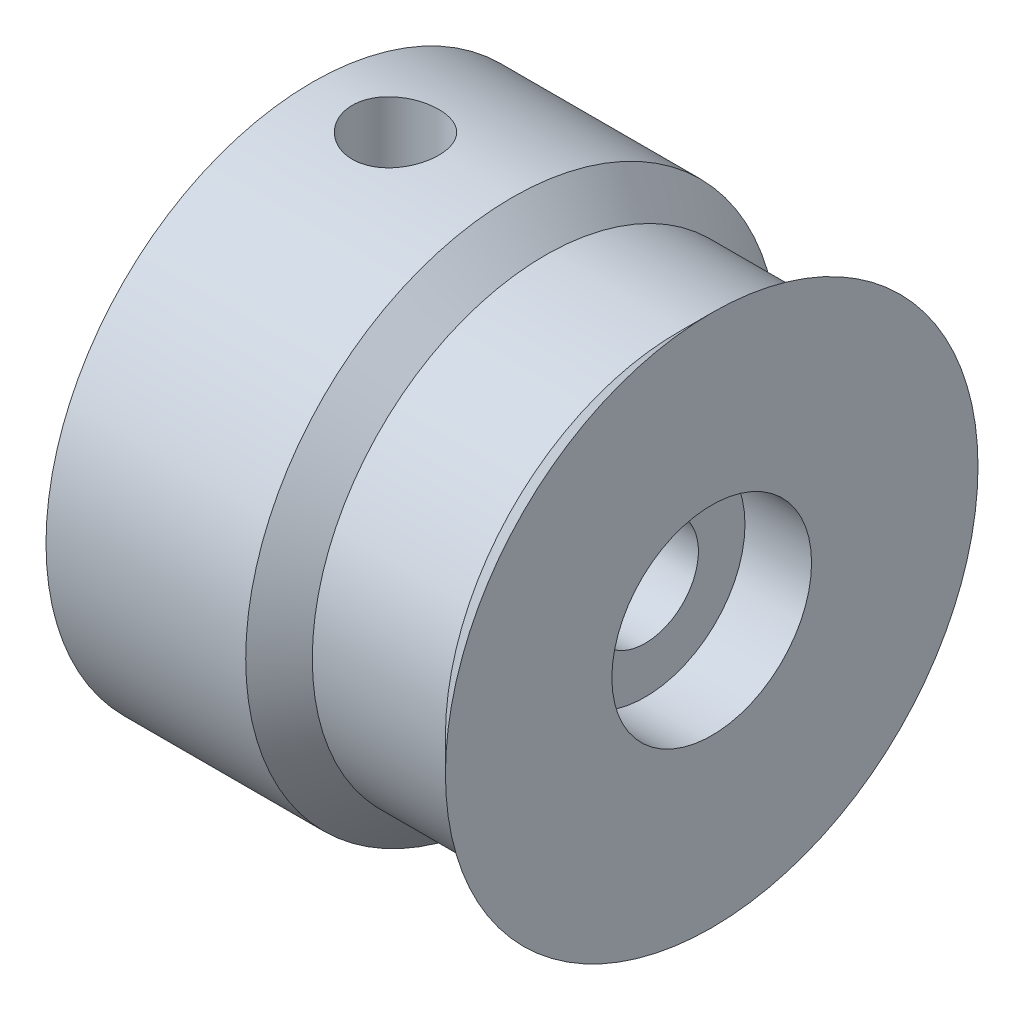
ISO-10303-21;
HEADER;
FILE_DESCRIPTION(('STEP AP214'),'2;1');
FILE_NAME('part.step','',(''),(''),'','','');
FILE_SCHEMA(('AUTOMOTIVE_DESIGN { 1 0 10303 214 1 1 1 1 }'));
ENDSEC;
DATA;
#1=APPLICATION_CONTEXT('core data for automotive mechanical design processes');
#2=APPLICATION_PROTOCOL_DEFINITION('international standard','automotive_design',2000,#1);
#3=PRODUCT_CONTEXT('',#1,'mechanical');
#4=PRODUCT('Part','Part','',(#3));
#5=PRODUCT_RELATED_PRODUCT_CATEGORY('part','',(#4));
#6=PRODUCT_DEFINITION_FORMATION('','',#4);
#7=PRODUCT_DEFINITION_CONTEXT('part definition',#1,'design');
#8=PRODUCT_DEFINITION('design','',#6,#7);
#9=PRODUCT_DEFINITION_SHAPE('','',#8);
#10=(LENGTH_UNIT() NAMED_UNIT(*) SI_UNIT(.MILLI.,.METRE.));
#11=(NAMED_UNIT(*) PLANE_ANGLE_UNIT() SI_UNIT($,.RADIAN.));
#12=(NAMED_UNIT(*) SI_UNIT($,.STERADIAN.) SOLID_ANGLE_UNIT());
#13=UNCERTAINTY_MEASURE_WITH_UNIT(LENGTH_MEASURE(1.E-05),#10,'distance_accuracy_value','');
#14=(GEOMETRIC_REPRESENTATION_CONTEXT(3) GLOBAL_UNCERTAINTY_ASSIGNED_CONTEXT((#13)) GLOBAL_UNIT_ASSIGNED_CONTEXT((#10,
#11,#12)) REPRESENTATION_CONTEXT('',''));
#15=CARTESIAN_POINT('',(0.,0.,0.));
#16=DIRECTION('',(0.,0.,1.));
#17=DIRECTION('',(1.,0.,0.));
#18=AXIS2_PLACEMENT_3D('',#15,#16,#17);
#19=CARTESIAN_POINT('',(0.,0.,0.));
#20=DIRECTION('',(-1.,0.,0.));
#21=DIRECTION('',(0.,0.,1.));
#22=AXIS2_PLACEMENT_3D('',#19,#20,#21);
#23=CYLINDRICAL_SURFACE('',#22,4.5);
#24=CARTESIAN_POINT('',(2.5,-4.3081318457076,1.3));
#25=CARTESIAN_POINT('',(2.42863313340239,-4.30813279337262,1.29999879655539));
#26=CARTESIAN_POINT('',(2.35725418050508,-4.30992460250792,1.29410319221496));
#27=CARTESIAN_POINT('',(2.21657434262258,-4.31687214490348,1.27073167094706));
#28=CARTESIAN_POINT('',(2.14727428056843,-4.32202919238679,1.25325122976364));
#29=CARTESIAN_POINT('',(2.01280849936003,-4.33507545889643,1.20734607027228));
#30=CARTESIAN_POINT('',(1.94763646231685,-4.34296037725375,1.17893857135605));
#31=CARTESIAN_POINT('',(1.82296911633117,-4.36056825441867,1.11204142797774));
#32=CARTESIAN_POINT('',(1.76347452173565,-4.37029144406354,1.07355051707678));
#33=CARTESIAN_POINT('',(1.65010507916228,-4.39080022895354,0.98637030903215));
#34=CARTESIAN_POINT('',(1.59642148830366,-4.4016071843155,0.937437270307317));
#35=CARTESIAN_POINT('',(1.49789697508779,-4.4228827226542,0.831284833703608));
#36=CARTESIAN_POINT('',(1.45305710970524,-4.43335126506001,0.77406444676219));
#37=CARTESIAN_POINT('',(1.37267381425754,-4.4530116193173,0.651612873102253));
#38=CARTESIAN_POINT('',(1.33732371314498,-4.46217531657916,0.586249867602601));
#39=CARTESIAN_POINT('',(1.27818976446839,-4.47794638161977,0.450197924487183));
#40=CARTESIAN_POINT('',(1.25440361234816,-4.4845542586891,0.379510051299344));
#41=CARTESIAN_POINT('',(1.21970087002154,-4.49431805545872,0.236814351710887));
#42=CARTESIAN_POINT('',(1.20845819821795,-4.49756127708926,0.164891906721939));
#43=CARTESIAN_POINT('',(1.1981322650655,-4.50053702343425,0.0201134330144835));
#44=CARTESIAN_POINT('',(1.19904662933593,-4.50027023368624,-0.0527424106257846));
#45=CARTESIAN_POINT('',(1.21278621210107,-4.49631851041019,-0.195038192165016));
#46=CARTESIAN_POINT('',(1.22525860652349,-4.49273483318493,-0.264515447716657));
#47=CARTESIAN_POINT('',(1.26118606229288,-4.48267381509879,-0.400345137085308));
#48=CARTESIAN_POINT('',(1.28464179826871,-4.47619629649084,-0.466697378679286));
#49=CARTESIAN_POINT('',(1.34211971729442,-4.46093192671849,-0.595253525445509));
#50=CARTESIAN_POINT('',(1.37625625238594,-4.45212024987467,-0.657403234305083));
#51=CARTESIAN_POINT('',(1.45403729655884,-4.43312741609808,-0.77520764005173));
#52=CARTESIAN_POINT('',(1.49768392755008,-4.42294595373053,-0.830860883172866));
#53=CARTESIAN_POINT('',(1.59509133277135,-4.40187720157316,-0.93619885317004));
#54=CARTESIAN_POINT('',(1.64915860875884,-4.39097769333332,-0.985598074303785));
#55=CARTESIAN_POINT('',(1.76491893964752,-4.37002396309914,-1.07470529597395));
#56=CARTESIAN_POINT('',(1.82661264166663,-4.35996981295697,-1.11441247326905));
#57=CARTESIAN_POINT('',(1.95657991051588,-4.34178979127668,-1.18327766553921));
#58=CARTESIAN_POINT('',(2.02490396013413,-4.33368066234716,-1.21234514489363));
#59=CARTESIAN_POINT('',(2.16576439552729,-4.32051009837503,-1.25848109175824));
#60=CARTESIAN_POINT('',(2.23829951660482,-4.31544775344034,-1.27555314184071));
#61=CARTESIAN_POINT('',(2.38282184098649,-4.30914165688786,-1.29669443440491));
#62=CARTESIAN_POINT('',(2.45474050023348,-4.30777132725947,-1.30119489180942));
#63=CARTESIAN_POINT('',(2.5983055701485,-4.30865565372649,-1.29826392009081));
#64=CARTESIAN_POINT('',(2.66995201448997,-4.31090984579008,-1.29083401836002));
#65=CARTESIAN_POINT('',(2.80918855044871,-4.31866565307569,-1.26463600768684));
#66=CARTESIAN_POINT('',(2.87683443903039,-4.32408951592606,-1.24613912260729));
#67=CARTESIAN_POINT('',(3.00806023636331,-4.33749455345838,-1.19864336546959));
#68=CARTESIAN_POINT('',(3.07163954761862,-4.34547610290657,-1.16964295429609));
#69=CARTESIAN_POINT('',(3.19469860739096,-4.36334757007066,-1.10112580806327));
#70=CARTESIAN_POINT('',(3.25403461584527,-4.37328052154304,-1.06136240904809));
#71=CARTESIAN_POINT('',(3.36534977334943,-4.39384020295062,-0.972745307116469));
#72=CARTESIAN_POINT('',(3.41732728700106,-4.40446708634517,-0.923889589032521));
#73=CARTESIAN_POINT('',(3.51430268373141,-4.42566266708536,-0.816458539964099));
#74=CARTESIAN_POINT('',(3.55899653204609,-4.43621660553728,-0.75760521027823));
#75=CARTESIAN_POINT('',(3.63787734308449,-4.45570415572188,-0.632986454057171));
#76=CARTESIAN_POINT('',(3.67206485049052,-4.46463785144328,-0.5672213860859));
#77=CARTESIAN_POINT('',(3.72863492647104,-4.47982185418223,-0.431097666090435));
#78=CARTESIAN_POINT('',(3.75110673971043,-4.48609237794587,-0.360778469683259));
#79=CARTESIAN_POINT('',(3.78384862342349,-4.49533282609701,-0.217149993572304));
#80=CARTESIAN_POINT('',(3.79412190904628,-4.49830362017639,-0.143841507022852));
#81=CARTESIAN_POINT('',(3.80194521743192,-4.5005609969933,0.00086478569657411));
#82=CARTESIAN_POINT('',(3.79993778585208,-4.4999757305733,0.0722369779856471));
#83=CARTESIAN_POINT('',(3.78430407336059,-4.49548456821128,0.213584667702757));
#84=CARTESIAN_POINT('',(3.770678370665,-4.49157883752157,0.283560234460442));
#85=CARTESIAN_POINT('',(3.73246125574994,-4.48091846816225,0.419499089830076));
#86=CARTESIAN_POINT('',(3.70797322399843,-4.47419071966314,0.485493693782462));
#87=CARTESIAN_POINT('',(3.64881860497552,-4.45858419784331,0.61247364431595));
#88=CARTESIAN_POINT('',(3.61415041921729,-4.44970508675414,0.673458202294096));
#89=CARTESIAN_POINT('',(3.53440142553314,-4.43040042487549,0.790689821396192));
#90=CARTESIAN_POINT('',(3.4890374084932,-4.41993622519236,0.846737818365894));
#91=CARTESIAN_POINT('',(3.38970372155392,-4.39877503190667,0.950574554932919));
#92=CARTESIAN_POINT('',(3.33573165248964,-4.38807797412368,0.998360984173664));
#93=CARTESIAN_POINT('',(3.2189614577137,-4.36732427882032,1.08560952040857));
#94=CARTESIAN_POINT('',(3.15596420294237,-4.35729276608927,1.12481171852487));
#95=CARTESIAN_POINT('',(3.02399206857295,-4.3393903261111,1.19201870329893));
#96=CARTESIAN_POINT('',(2.95502045814742,-4.33151822693584,1.22002956735153));
#97=CARTESIAN_POINT('',(2.82210275824001,-4.31971524804284,1.26113306764733));
#98=CARTESIAN_POINT('',(2.75863347012585,-4.31541039934175,1.27567015216104));
#99=CARTESIAN_POINT('',(2.63011262613961,-4.30961850077265,1.29510336433635));
#100=CARTESIAN_POINT('',(2.56506133552479,-4.30813098177235,1.30000109711575));
#101=CARTESIAN_POINT('',(2.5,-4.3081318457076,1.3));
#102=B_SPLINE_CURVE_WITH_KNOTS('',3,(#24,#25,#26,#27,#28,#29,#30,#31,#32,#33,#34,#35,#36,#37,
#38,#39,#40,#41,#42,#43,#44,#45,#46,#47,#48,#49,#50,#51,#52,#53,#54,#55,#56,#57,#58,#59,#60,#61,
#62,#63,#64,#65,#66,#67,#68,#69,#70,#71,#72,#73,#74,#75,#76,#77,#78,#79,#80,#81,#82,#83,#84,#85,
#86,#87,#88,#89,#90,#91,#92,#93,#94,#95,#96,#97,#98,#99,#100,#101),.UNSPECIFIED.,.T.,.F.,(4,2,2,
2,2,2,2,2,2,2,2,2,2,2,2,2,2,2,2,2,2,2,2,2,2,2,2,2,2,2,2,2,2,2,2,2,2,2,4),(0.,0.213860870542837,
0.4278053099732,0.641413977441894,0.855049486234427,1.07435981505186,1.29369633929887,
1.51721041433874,1.74067992742904,1.95819395425293,2.17566549921533,2.38670967120679,
2.59776680784726,2.81116572194292,3.0246122988385,3.24571109914732,3.4668286730377,
3.68978629948542,3.91267730874919,4.1278231775052,4.34294150426129,4.55299216669133,
4.76307362097933,4.97845072919737,5.19387562928726,5.41676062860847,5.63963407090831,
5.86078400399119,6.08187563594332,6.29504813910956,6.5082100337637,6.71938532617077,
6.93059379504957,7.14819007172284,7.36584710135083,7.58938717467547,7.81280569020901,
8.00780362177071,8.20276908007593),.UNSPECIFIED.);
#103=CARTESIAN_POINT('',(2.5,-4.3081318457076,1.3));
#104=VERTEX_POINT('',#103);
#105=EDGE_CURVE('E78',#104,#104,#102,.T.);
#106=ORIENTED_EDGE('',*,*,#105,.T.);
#107=EDGE_LOOP('',(#106));
#108=FACE_BOUND('',#107,.T.);
#109=CARTESIAN_POINT('',(2.5,4.3081318457076,1.3));
#110=CARTESIAN_POINT('',(2.57136686659761,4.30813279337262,1.29999879655539));
#111=CARTESIAN_POINT('',(2.64274581949492,4.30992460250792,1.29410319221496));
#112=CARTESIAN_POINT('',(2.78342565737742,4.31687214490348,1.27073167094706));
#113=CARTESIAN_POINT('',(2.85272571943157,4.32202919238679,1.25325122976364));
#114=CARTESIAN_POINT('',(2.98719150063997,4.33507545889643,1.20734607027228));
#115=CARTESIAN_POINT('',(3.05236353768315,4.34296037725375,1.17893857135605));
#116=CARTESIAN_POINT('',(3.17703088366883,4.36056825441867,1.11204142797774));
#117=CARTESIAN_POINT('',(3.23652547826435,4.37029144406354,1.07355051707678));
#118=CARTESIAN_POINT('',(3.34989492083772,4.39080022895354,0.98637030903215));
#119=CARTESIAN_POINT('',(3.40357851169634,4.4016071843155,0.937437270307317));
#120=CARTESIAN_POINT('',(3.50210302491221,4.4228827226542,0.831284833703608));
#121=CARTESIAN_POINT('',(3.54694289029476,4.43335126506001,0.774064446762191));
#122=CARTESIAN_POINT('',(3.62732618574246,4.4530116193173,0.651612873102254));
#123=CARTESIAN_POINT('',(3.66267628685502,4.46217531657916,0.586249867602601));
#124=CARTESIAN_POINT('',(3.72181023553161,4.47794638161977,0.450197924487183));
#125=CARTESIAN_POINT('',(3.74559638765184,4.4845542586891,0.379510051299344));
#126=CARTESIAN_POINT('',(3.78029912997846,4.49431805545872,0.236814351710887));
#127=CARTESIAN_POINT('',(3.79154180178205,4.49756127708926,0.16489190672194));
#128=CARTESIAN_POINT('',(3.8018677349345,4.50053702343425,0.0201134330144837));
#129=CARTESIAN_POINT('',(3.80095337066407,4.50027023368624,-0.0527424106257845));
#130=CARTESIAN_POINT('',(3.78721378789893,4.49631851041019,-0.195038192165016));
#131=CARTESIAN_POINT('',(3.77474139347651,4.49273483318493,-0.264515447716657));
#132=CARTESIAN_POINT('',(3.73881393770712,4.48267381509879,-0.400345137085308));
#133=CARTESIAN_POINT('',(3.71535820173129,4.47619629649084,-0.466697378679286));
#134=CARTESIAN_POINT('',(3.65788028270558,4.46093192671849,-0.595253525445509));
#135=CARTESIAN_POINT('',(3.62374374761406,4.45212024987467,-0.657403234305084));
#136=CARTESIAN_POINT('',(3.54596270344116,4.43312741609808,-0.77520764005173));
#137=CARTESIAN_POINT('',(3.50231607244992,4.42294595373053,-0.830860883172866));
#138=CARTESIAN_POINT('',(3.40490866722865,4.40187720157316,-0.93619885317004));
#139=CARTESIAN_POINT('',(3.35084139124116,4.39097769333332,-0.985598074303786));
#140=CARTESIAN_POINT('',(3.23508106035248,4.37002396309914,-1.07470529597395));
#141=CARTESIAN_POINT('',(3.17338735833337,4.35996981295697,-1.11441247326905));
#142=CARTESIAN_POINT('',(3.04342008948412,4.34178979127668,-1.18327766553921));
#143=CARTESIAN_POINT('',(2.97509603986587,4.33368066234716,-1.21234514489363));
#144=CARTESIAN_POINT('',(2.83423560447271,4.32051009837503,-1.25848109175824));
#145=CARTESIAN_POINT('',(2.76170048339518,4.31544775344034,-1.27555314184071));
#146=CARTESIAN_POINT('',(2.6171781590135,4.30914165688786,-1.29669443440491));
#147=CARTESIAN_POINT('',(2.54525949976652,4.30777132725947,-1.30119489180942));
#148=CARTESIAN_POINT('',(2.4016944298515,4.30865565372649,-1.29826392009081));
#149=CARTESIAN_POINT('',(2.33004798551003,4.31090984579008,-1.29083401836002));
#150=CARTESIAN_POINT('',(2.19081144955129,4.31866565307569,-1.26463600768684));
#151=CARTESIAN_POINT('',(2.12316556096961,4.32408951592606,-1.24613912260729));
#152=CARTESIAN_POINT('',(1.99193976363669,4.33749455345838,-1.19864336546959));
#153=CARTESIAN_POINT('',(1.92836045238138,4.34547610290657,-1.16964295429609));
#154=CARTESIAN_POINT('',(1.80530139260904,4.36334757007066,-1.10112580806327));
#155=CARTESIAN_POINT('',(1.74596538415473,4.37328052154304,-1.06136240904809));
#156=CARTESIAN_POINT('',(1.63465022665057,4.39384020295062,-0.972745307116468));
#157=CARTESIAN_POINT('',(1.58267271299894,4.40446708634517,-0.923889589032521));
#158=CARTESIAN_POINT('',(1.48569731626859,4.42566266708536,-0.816458539964098));
#159=CARTESIAN_POINT('',(1.44100346795391,4.43621660553728,-0.75760521027823));
#160=CARTESIAN_POINT('',(1.36212265691551,4.45570415572188,-0.632986454057171));
#161=CARTESIAN_POINT('',(1.32793514950948,4.46463785144328,-0.5672213860859));
#162=CARTESIAN_POINT('',(1.27136507352896,4.47982185418223,-0.431097666090435));
#163=CARTESIAN_POINT('',(1.24889326028957,4.48609237794587,-0.360778469683259));
#164=CARTESIAN_POINT('',(1.21615137657651,4.49533282609701,-0.217149993572303));
#165=CARTESIAN_POINT('',(1.20587809095372,4.49830362017639,-0.143841507022851));
#166=CARTESIAN_POINT('',(1.19805478256808,4.5005609969933,0.000864785696574557));
#167=CARTESIAN_POINT('',(1.20006221414792,4.4999757305733,0.0722369779856476));
#168=CARTESIAN_POINT('',(1.21569592663941,4.49548456821128,0.213584667702757));
#169=CARTESIAN_POINT('',(1.229321629335,4.49157883752157,0.283560234460443));
#170=CARTESIAN_POINT('',(1.26753874425006,4.48091846816225,0.419499089830076));
#171=CARTESIAN_POINT('',(1.29202677600157,4.47419071966314,0.485493693782462));
#172=CARTESIAN_POINT('',(1.35118139502448,4.45858419784331,0.61247364431595));
#173=CARTESIAN_POINT('',(1.38584958078271,4.44970508675414,0.673458202294096));
#174=CARTESIAN_POINT('',(1.46559857446686,4.43040042487549,0.790689821396192));
#175=CARTESIAN_POINT('',(1.5109625915068,4.41993622519236,0.846737818365894));
#176=CARTESIAN_POINT('',(1.61029627844608,4.39877503190667,0.950574554932919));
#177=CARTESIAN_POINT('',(1.66426834751036,4.38807797412368,0.998360984173664));
#178=CARTESIAN_POINT('',(1.7810385422863,4.36732427882032,1.08560952040857));
#179=CARTESIAN_POINT('',(1.84403579705763,4.35729276608927,1.12481171852486));
#180=CARTESIAN_POINT('',(1.97600793142705,4.3393903261111,1.19201870329893));
#181=CARTESIAN_POINT('',(2.04497954185258,4.33151822693584,1.22002956735153));
#182=CARTESIAN_POINT('',(2.17789724175999,4.31971524804284,1.26113306764733));
#183=CARTESIAN_POINT('',(2.24136652987415,4.31541039934175,1.27567015216104));
#184=CARTESIAN_POINT('',(2.36988737386039,4.30961850077265,1.29510336433635));
#185=CARTESIAN_POINT('',(2.43493866447521,4.30813098177235,1.30000109711575));
#186=CARTESIAN_POINT('',(2.5,4.3081318457076,1.3));
#187=B_SPLINE_CURVE_WITH_KNOTS('',3,(#109,#110,#111,#112,#113,#114,#115,#116,#117,#118,#119,
#120,#121,#122,#123,#124,#125,#126,#127,#128,#129,#130,#131,#132,#133,#134,#135,#136,#137,#138,
#139,#140,#141,#142,#143,#144,#145,#146,#147,#148,#149,#150,#151,#152,#153,#154,#155,#156,#157,
#158,#159,#160,#161,#162,#163,#164,#165,#166,#167,#168,#169,#170,#171,#172,#173,#174,#175,#176,
#177,#178,#179,#180,#181,#182,#183,#184,#185,#186),.UNSPECIFIED.,.T.,.F.,(4,2,2,2,2,2,2,2,2,2,2,
2,2,2,2,2,2,2,2,2,2,2,2,2,2,2,2,2,2,2,2,2,2,2,2,2,2,2,4),(0.,0.213860870542838,0.4278053099732,
0.641413977441894,0.855049486234427,1.07435981505186,1.29369633929887,1.51721041433874,
1.74067992742904,1.95819395425293,2.17566549921533,2.38670967120679,2.59776680784726,
2.81116572194292,3.0246122988385,3.24571109914732,3.4668286730377,3.68978629948542,
3.91267730874919,4.1278231775052,4.34294150426129,4.55299216669133,4.76307362097933,
4.97845072919737,5.19387562928726,5.41676062860847,5.63963407090831,5.86078400399119,
6.08187563594332,6.29504813910956,6.5082100337637,6.71938532617077,6.93059379504956,
7.14819007172283,7.36584710135083,7.58938717467547,7.81280569020901,8.0078036217707,
8.20276908007593),.UNSPECIFIED.);
#188=CARTESIAN_POINT('',(2.5,4.3081318457076,1.3));
#189=VERTEX_POINT('',#188);
#190=EDGE_CURVE('E73',#189,#189,#187,.T.);
#191=ORIENTED_EDGE('',*,*,#190,.T.);
#192=EDGE_LOOP('',(#191));
#193=FACE_BOUND('',#192,.T.);
#194=CARTESIAN_POINT('',(5.,0.,0.));
#195=DIRECTION('',(-1.,0.,0.));
#196=DIRECTION('',(0.,0.,1.));
#197=AXIS2_PLACEMENT_3D('',#194,#195,#196);
#198=CIRCLE('',#197,4.5);
#199=CARTESIAN_POINT('',(5.,0.,4.5));
#200=VERTEX_POINT('',#199);
#201=EDGE_CURVE('E131',#200,#200,#198,.T.);
#202=ORIENTED_EDGE('',*,*,#201,.F.);
#203=EDGE_LOOP('',(#202));
#204=FACE_BOUND('',#203,.T.);
#205=CARTESIAN_POINT('',(0.,0.,0.));
#206=DIRECTION('',(-1.,0.,0.));
#207=DIRECTION('',(0.,0.,1.));
#208=AXIS2_PLACEMENT_3D('',#205,#206,#207);
#209=CIRCLE('',#208,4.5);
#210=CARTESIAN_POINT('',(0.,0.,4.5));
#211=VERTEX_POINT('',#210);
#212=EDGE_CURVE('E46',#211,#211,#209,.T.);
#213=ORIENTED_EDGE('',*,*,#212,.T.);
#214=EDGE_LOOP('',(#213));
#215=FACE_BOUND('',#214,.T.);
#216=ADVANCED_FACE('F31',(#108,#193,#204,#215),#23,.F.);
#217=CARTESIAN_POINT('',(0.,4.5,0.));
#218=DIRECTION('',(1.,0.,0.));
#219=DIRECTION('',(0.,0.,-1.));
#220=AXIS2_PLACEMENT_3D('',#217,#218,#219);
#221=PLANE('',#220);
#222=ORIENTED_EDGE('',*,*,#212,.F.);
#223=EDGE_LOOP('',(#222));
#224=FACE_BOUND('',#223,.T.);
#225=CARTESIAN_POINT('',(0.,0.,0.));
#226=DIRECTION('',(-1.,0.,0.));
#227=DIRECTION('',(0.,0.,1.));
#228=AXIS2_PLACEMENT_3D('',#225,#226,#227);
#229=CIRCLE('',#228,8.);
#230=CARTESIAN_POINT('',(0.,0.,8.));
#231=VERTEX_POINT('',#230);
#232=EDGE_CURVE('E98',#231,#231,#229,.T.);
#233=ORIENTED_EDGE('',*,*,#232,.T.);
#234=EDGE_LOOP('',(#233));
#235=FACE_BOUND('',#234,.T.);
#236=ADVANCED_FACE('F84',(#224,#235),#221,.F.);
#237=CARTESIAN_POINT('',(0.,0.,0.));
#238=DIRECTION('',(-1.,0.,0.));
#239=DIRECTION('',(0.,0.,1.));
#240=AXIS2_PLACEMENT_3D('',#237,#238,#239);
#241=CYLINDRICAL_SURFACE('',#240,8.);
#242=CARTESIAN_POINT('',(6.,0.,0.));
#243=DIRECTION('',(-1.,0.,0.));
#244=DIRECTION('',(0.,0.,1.));
#245=AXIS2_PLACEMENT_3D('',#242,#243,#244);
#246=CIRCLE('',#245,8.);
#247=CARTESIAN_POINT('',(6.,0.,8.));
#248=VERTEX_POINT('',#247);
#249=EDGE_CURVE('E10',#248,#248,#246,.T.);
#250=ORIENTED_EDGE('',*,*,#249,.T.);
#251=EDGE_LOOP('',(#250));
#252=FACE_BOUND('',#251,.T.);
#253=CARTESIAN_POINT('',(1.2,-8.,0.));
#254=CARTESIAN_POINT('',(1.2000029300165,-7.99999877592626,0.0725095828112704));
#255=CARTESIAN_POINT('',(1.20608699718836,-7.99900390777849,0.145059388819583));
#256=CARTESIAN_POINT('',(1.23025342466369,-7.99513096859397,0.288126000295136));
#257=CARTESIAN_POINT('',(1.24834698679901,-7.99225113939847,0.358640843517908));
#258=CARTESIAN_POINT('',(1.29597317246314,-7.98493144938236,0.495546797148884));
#259=CARTESIAN_POINT('',(1.32549662246252,-7.98049283989006,0.56194116515622));
#260=CARTESIAN_POINT('',(1.39512090828833,-7.970544256177,0.688824823603404));
#261=CARTESIAN_POINT('',(1.43522046746726,-7.96503441128668,0.749314825555633));
#262=CARTESIAN_POINT('',(1.52524734442115,-7.95349854575466,0.863232474652934));
#263=CARTESIAN_POINT('',(1.57525209328737,-7.94746868433394,0.916598547137692));
#264=CARTESIAN_POINT('',(1.68350323791855,-7.93560195711605,1.01422174575476));
#265=CARTESIAN_POINT('',(1.74175014120837,-7.92976510323098,1.0584783105412));
#266=CARTESIAN_POINT('',(1.86525278519466,-7.91890805241826,1.13687116645584));
#267=CARTESIAN_POINT('',(1.93054743513391,-7.91389281882856,1.17094690599569));
#268=CARTESIAN_POINT('',(2.06602884461901,-7.90529992824683,1.22762367619701));
#269=CARTESIAN_POINT('',(2.13621529009625,-7.90172217906336,1.25022544275314));
#270=CARTESIAN_POINT('',(2.27883653375503,-7.89644745937893,1.28311939096235));
#271=CARTESIAN_POINT('',(2.35124625525515,-7.89473429032826,1.29351765363673));
#272=CARTESIAN_POINT('',(2.49680143823434,-7.89333365725974,1.30203825919572));
#273=CARTESIAN_POINT('',(2.56994684987676,-7.8936460569377,1.30016142809356));
#274=CARTESIAN_POINT('',(2.71414187768928,-7.8962464684475,1.2842716024239));
#275=CARTESIAN_POINT('',(2.78520499614365,-7.89851512400555,1.27037750918883));
#276=CARTESIAN_POINT('',(2.92397782724531,-7.90474214421385,1.23103403692772));
#277=CARTESIAN_POINT('',(2.99168742999395,-7.90870056419883,1.20558427948649));
#278=CARTESIAN_POINT('',(3.12218866205063,-7.91788213110462,1.14373054902833));
#279=CARTESIAN_POINT('',(3.18495634996638,-7.92311098672497,1.10727694580075));
#280=CARTESIAN_POINT('',(3.30352897608272,-7.93424026020097,1.02448557246114));
#281=CARTESIAN_POINT('',(3.35933337895922,-7.94014072962243,0.978147043155891));
#282=CARTESIAN_POINT('',(3.46308383250411,-7.95203357083555,0.876252110118097));
#283=CARTESIAN_POINT('',(3.51092966379517,-7.95802620693036,0.820593635112808));
#284=CARTESIAN_POINT('',(3.59661757301241,-7.96936389180269,0.701984653391879));
#285=CARTESIAN_POINT('',(3.63445959224648,-7.9747089367807,0.639034103896943));
#286=CARTESIAN_POINT('',(3.69907376780208,-7.9841562463891,0.507535588638655));
#287=CARTESIAN_POINT('',(3.72583736191113,-7.98825754911292,0.438983342288912));
#288=CARTESIAN_POINT('',(3.76744348983573,-7.99474746893962,0.298275495888334));
#289=CARTESIAN_POINT('',(3.78228697109302,-7.9971362221588,0.226120182702995));
#290=CARTESIAN_POINT('',(3.7994963356547,-7.99991366373812,0.0811185260875712));
#291=CARTESIAN_POINT('',(3.80199985124625,-8.00032441233439,0.00828892497690026));
#292=CARTESIAN_POINT('',(3.7948247329257,-7.99915988938481,-0.136749343255564));
#293=CARTESIAN_POINT('',(3.78514654383882,-7.99758469035751,-0.208958032953522));
#294=CARTESIAN_POINT('',(3.75399721460496,-7.99263891610011,-0.350281753570621));
#295=CARTESIAN_POINT('',(3.73259393223246,-7.98927867497569,-0.419412133937191));
#296=CARTESIAN_POINT('',(3.67867411328201,-7.98113815078947,-0.553103373785394));
#297=CARTESIAN_POINT('',(3.64615697845951,-7.9763577912863,-0.6176639870564));
#298=CARTESIAN_POINT('',(3.57061528796483,-7.96585282283067,-0.740982798883124));
#299=CARTESIAN_POINT('',(3.5275044131469,-7.96012058902579,-0.799687458820176));
#300=CARTESIAN_POINT('',(3.43211811406468,-7.94837149702426,-0.909078046139236));
#301=CARTESIAN_POINT('',(3.3798420589575,-7.94235461925628,-0.959763421093611));
#302=CARTESIAN_POINT('',(3.26699320813671,-7.93064340324749,-1.05218441600946));
#303=CARTESIAN_POINT('',(3.2063439571182,-7.92495281392582,-1.09382723099675));
#304=CARTESIAN_POINT('',(3.07883023357463,-7.91460755577882,-1.16633367026904));
#305=CARTESIAN_POINT('',(3.01196595095278,-7.90995285531614,-1.19719762377024));
#306=CARTESIAN_POINT('',(2.87418415243292,-7.90223427645726,-1.24713011291537));
#307=CARTESIAN_POINT('',(2.80328399493273,-7.89916408364438,-1.26624552673198));
#308=CARTESIAN_POINT('',(2.65922536827743,-7.89494605032352,-1.29228629622853));
#309=CARTESIAN_POINT('',(2.5860670853533,-7.89379805171844,-1.29921265443935));
#310=CARTESIAN_POINT('',(2.44049516290508,-7.89356096839905,-1.3006518008219));
#311=CARTESIAN_POINT('',(2.36808296488683,-7.89444766225264,-1.29531062377487));
#312=CARTESIAN_POINT('',(2.22520191672322,-7.89812708660047,-1.27268135683473));
#313=CARTESIAN_POINT('',(2.15473306115785,-7.90091981177821,-1.25539330026526));
#314=CARTESIAN_POINT('',(2.01779138379657,-7.90808761435019,-1.20941586278521));
#315=CARTESIAN_POINT('',(1.9513144532743,-7.91246103108221,-1.18073844433578));
#316=CARTESIAN_POINT('',(1.8240917161962,-7.92229915201493,-1.11281119547968));
#317=CARTESIAN_POINT('',(1.763346170935,-7.92776390593448,-1.07356088336749));
#318=CARTESIAN_POINT('',(1.64857163860573,-7.93924603633553,-0.985078380192997));
#319=CARTESIAN_POINT('',(1.59462617008184,-7.94526895248518,-0.935738557761988));
#320=CARTESIAN_POINT('',(1.49572997115203,-7.95714406140989,-0.828704791495918));
#321=CARTESIAN_POINT('',(1.45078132265166,-7.96299621440256,-0.771008919343973));
#322=CARTESIAN_POINT('',(1.37088770679926,-7.97391458067293,-0.648453805353276));
#323=CARTESIAN_POINT('',(1.33601001917618,-7.97897540904427,-0.583550223287052));
#324=CARTESIAN_POINT('',(1.27770533902918,-7.98768843828174,-0.448750907680785));
#325=CARTESIAN_POINT('',(1.25426682353297,-7.99134205588182,-0.378860279427687));
#326=CARTESIAN_POINT('',(1.22465314609802,-7.99602212678735,-0.2572390524972));
#327=CARTESIAN_POINT('',(1.21542284483722,-7.99750593753365,-0.206248262165979));
#328=CARTESIAN_POINT('',(1.20309527461419,-7.99949530331405,-0.103511806924209));
#329=CARTESIAN_POINT('',(1.19999790819807,-8.00000087389263,-0.0517661540217815));
#330=CARTESIAN_POINT('',(1.2,-8.,0.));
#331=B_SPLINE_CURVE_WITH_KNOTS('',3,(#253,#254,#255,#256,#257,#258,#259,#260,#261,#262,#263,
#264,#265,#266,#267,#268,#269,#270,#271,#272,#273,#274,#275,#276,#277,#278,#279,#280,#281,#282,
#283,#284,#285,#286,#287,#288,#289,#290,#291,#292,#293,#294,#295,#296,#297,#298,#299,#300,#301,
#302,#303,#304,#305,#306,#307,#308,#309,#310,#311,#312,#313,#314,#315,#316,#317,#318,#319,#320,
#321,#322,#323,#324,#325,#326,#327,#328,#329,#330),.UNSPECIFIED.,.T.,.F.,(4,2,2,2,2,2,2,2,2,2,2,
2,2,2,2,2,2,2,2,2,2,2,2,2,2,2,2,2,2,2,2,2,2,2,2,2,2,2,4),(0.,0.217339544208659,
0.434882096851803,0.652250412471408,0.869592501450791,1.08870588987873,1.30783277646703,
1.52823812378532,1.74862933340133,1.96709022194282,2.18553641000777,2.40184565352002,
2.61816198105678,2.83546891122118,3.05279253724968,3.27267396345838,3.49255667967709,
3.71260902136668,3.93264387098896,4.15021894722098,4.36778607874586,4.58410716468156,
4.80043989674099,5.0185974523053,5.23677002963764,5.45708573444195,5.67739470960741,
5.89681881792264,6.11622487810232,6.33303264952927,6.54983981621314,6.76641986593183,
6.98300978479871,7.2020435503968,7.42112794296725,7.64164376421293,7.86193699335627,
8.01710284409207,8.17226622918301),.UNSPECIFIED.);
#332=CARTESIAN_POINT('',(1.2,-8.,0.));
#333=VERTEX_POINT('',#332);
#334=EDGE_CURVE('E38',#333,#333,#331,.T.);
#335=ORIENTED_EDGE('',*,*,#334,.T.);
#336=EDGE_LOOP('',(#335));
#337=FACE_BOUND('',#336,.T.);
#338=CARTESIAN_POINT('',(2.5,7.89366834874635,1.3));
#339=CARTESIAN_POINT('',(2.42749754227879,7.89366963502151,1.29999706400224));
#340=CARTESIAN_POINT('',(2.35495484323127,7.89467806097705,1.29391415210118));
#341=CARTESIAN_POINT('',(2.21190299361244,7.89859937474209,1.26975272964571));
#342=CARTESIAN_POINT('',(2.14139581097104,7.90151404509877,1.25166299115863));
#343=CARTESIAN_POINT('',(2.00450606962003,7.90890921292528,1.2040479869994));
#344=CARTESIAN_POINT('',(1.93812018845081,7.91338842928455,1.17453207538298));
#345=CARTESIAN_POINT('',(1.81125079963491,7.92340647775842,1.10492555184264));
#346=CARTESIAN_POINT('',(1.75076659059765,7.92894518372464,1.06483619863292));
#347=CARTESIAN_POINT('',(1.63684260451119,7.94051617424584,0.974819716983149));
#348=CARTESIAN_POINT('',(1.58346618917106,7.94655221010937,0.924812870088156));
#349=CARTESIAN_POINT('',(1.48582297019366,7.95840438689751,0.816553159756219));
#350=CARTESIAN_POINT('',(1.44155669612532,7.96422051502294,0.758299817285748));
#351=CARTESIAN_POINT('',(1.36315352318434,7.975017142814,0.63479132902566));
#352=CARTESIAN_POINT('',(1.32907543728166,7.97999272119001,0.569498381858623));
#353=CARTESIAN_POINT('',(1.27239386220179,7.98850594095893,0.434020665687448));
#354=CARTESIAN_POINT('',(1.24978966337095,7.99204367127927,0.363836199526533));
#355=CARTESIAN_POINT('',(1.21689087370991,7.99725611078537,0.221221845420811));
#356=CARTESIAN_POINT('',(1.20648990803098,7.99894691047636,0.148817094077698));
#357=CARTESIAN_POINT('',(1.19796217340105,8.00033022937454,0.00327170401203757));
#358=CARTESIAN_POINT('',(1.19983460955969,8.00002287799255,-0.0698688867473264));
#359=CARTESIAN_POINT('',(1.21571731269228,7.99745729307057,-0.214082854892153));
#360=CARTESIAN_POINT('',(1.22961310950179,7.99521745859161,-0.285169213249102));
#361=CARTESIAN_POINT('',(1.26896798103252,7.98905908310429,-0.423987637805246));
#362=CARTESIAN_POINT('',(1.29442739416758,7.98514049296665,-0.491719605772524));
#363=CARTESIAN_POINT('',(1.3563014472833,7.97603349256638,-0.62224858312701));
#364=CARTESIAN_POINT('',(1.39276351977578,7.97083960291519,-0.685022710426239));
#365=CARTESIAN_POINT('',(1.47557314833073,7.95975952464218,-0.803604657182135));
#366=CARTESIAN_POINT('',(1.52192146585531,7.95387328270942,-0.859411939510661));
#367=CARTESIAN_POINT('',(1.62382355374295,7.94198345213945,-0.963151955836207));
#368=CARTESIAN_POINT('',(1.67947734589839,7.93597929311782,-1.01098642710342));
#369=CARTESIAN_POINT('',(1.79807283773374,7.92459615190489,-1.09665361726889));
#370=CARTESIAN_POINT('',(1.86101459836381,7.91921717494281,-1.13448625251189));
#371=CARTESIAN_POINT('',(1.99251030324892,7.90969324741335,-1.19909358396253));
#372=CARTESIAN_POINT('',(2.06106993728328,7.90554956815073,-1.22585689909062));
#373=CARTESIAN_POINT('',(2.20179390403281,7.89898679728952,-1.26746022549124));
#374=CARTESIAN_POINT('',(2.27395793542241,7.89656756178578,-1.28230123169579));
#375=CARTESIAN_POINT('',(2.4189643159327,7.893755298729,-1.29950122891436));
#376=CARTESIAN_POINT('',(2.49178964829437,7.89333956707513,-1.30200009164575));
#377=CARTESIAN_POINT('',(2.63681827815199,7.89452095967788,-1.29481719135271));
#378=CARTESIAN_POINT('',(2.709021598341,7.89611801018579,-1.28513587461238));
#379=CARTESIAN_POINT('',(2.85031516031483,7.90112407446424,-1.25398652691864));
#380=CARTESIAN_POINT('',(2.91942143116348,7.90452219975498,-1.23258929960677));
#381=CARTESIAN_POINT('',(3.05306711534938,7.91273843472651,-1.17868961976133));
#382=CARTESIAN_POINT('',(3.11760626742937,7.91755662555938,-1.14618653254749));
#383=CARTESIAN_POINT('',(3.24090936185694,7.92812304840558,-1.07066612063485));
#384=CARTESIAN_POINT('',(3.29961758073471,7.93387907988195,-1.02755892622744));
#385=CARTESIAN_POINT('',(3.40901705046947,7.94564963808751,-0.932177713512115));
#386=CARTESIAN_POINT('',(3.45970776589478,7.9516641820468,-0.879903083467969));
#387=CARTESIAN_POINT('',(3.55214187328588,7.96334567211186,-0.767052146228601));
#388=CARTESIAN_POINT('',(3.59379213615922,7.9690086070921,-0.706399080977506));
#389=CARTESIAN_POINT('',(3.66631162606588,7.97928500125367,-0.578875591616245));
#390=CARTESIAN_POINT('',(3.69718118835135,7.98389849306844,-0.512005360925882));
#391=CARTESIAN_POINT('',(3.74711707134855,7.99153871544037,-0.374226051751336));
#392=CARTESIAN_POINT('',(3.7662326910378,7.99457206520562,-0.303335223624959));
#393=CARTESIAN_POINT('',(3.79227702771013,7.99873816068847,-0.159296400041904));
#394=CARTESIAN_POINT('',(3.79920669587453,7.99987105474691,-0.0861485812094679));
#395=CARTESIAN_POINT('',(3.8006561272567,8.00010665413004,0.0594278333978864));
#396=CARTESIAN_POINT('',(3.79531779288991,7.99923257397047,0.131855018181434));
#397=CARTESIAN_POINT('',(3.77268896541338,7.99559967619372,0.274766783140633));
#398=CARTESIAN_POINT('',(3.75539853132564,7.99284086788374,0.345251372907444));
#399=CARTESIAN_POINT('',(3.70940972269933,7.98574729632042,0.482226889644924));
#400=CARTESIAN_POINT('',(3.68072283685547,7.9814141205522,0.548721761159702));
#401=CARTESIAN_POINT('',(3.61277105477703,7.97164559328406,0.675976474778191));
#402=CARTESIAN_POINT('',(3.57350569739173,7.96621019373711,0.736736066706043));
#403=CARTESIAN_POINT('',(3.48500587838687,7.95476558645623,0.851511619332048));
#404=CARTESIAN_POINT('',(3.43566727103977,7.94875076261886,0.905446724894217));
#405=CARTESIAN_POINT('',(3.32864029960273,7.9368647812332,1.00432257956433));
#406=CARTESIAN_POINT('',(3.27094998224555,7.93099365766957,1.04926121873695));
#407=CARTESIAN_POINT('',(3.14840012332766,7.92001749641924,1.12914313608501));
#408=CARTESIAN_POINT('',(3.08349522061693,7.91491784411164,1.164017565432));
#409=CARTESIAN_POINT('',(2.94869328087692,7.90612551947819,1.22231579647591));
#410=CARTESIAN_POINT('',(2.87880136354072,7.9024314281894,1.24575115311517));
#411=CARTESIAN_POINT('',(2.75718842100038,7.89769667115007,1.27535661808347));
#412=CARTESIAN_POINT('',(2.70620776597556,7.89619434756117,1.28458323999006));
#413=CARTESIAN_POINT('',(2.60349156767362,7.89417973552472,1.29690592766897));
#414=CARTESIAN_POINT('',(2.55175603702344,7.89366743053604,1.30000209586839));
#415=CARTESIAN_POINT('',(2.5,7.89366834874635,1.3));
#416=B_SPLINE_CURVE_WITH_KNOTS('',3,(#338,#339,#340,#341,#342,#343,#344,#345,#346,#347,#348,
#349,#350,#351,#352,#353,#354,#355,#356,#357,#358,#359,#360,#361,#362,#363,#364,#365,#366,#367,
#368,#369,#370,#371,#372,#373,#374,#375,#376,#377,#378,#379,#380,#381,#382,#383,#384,#385,#386,
#387,#388,#389,#390,#391,#392,#393,#394,#395,#396,#397,#398,#399,#400,#401,#402,#403,#404,#405,
#406,#407,#408,#409,#410,#411,#412,#413,#414,#415),.UNSPECIFIED.,.T.,.F.,(4,2,2,2,2,2,2,2,2,2,2,
2,2,2,2,2,2,2,2,2,2,2,2,2,2,2,2,2,2,2,2,2,2,2,2,2,2,2,4),(0.,0.217318134066722,
0.434839775494237,0.652183717766252,0.869501798021159,1.08864321240646,1.30779736180055,
1.52819321438896,1.74857543395249,1.9670219759093,2.18545437025332,2.40182974790513,
2.61821145827679,2.83553965119993,3.05288458930554,3.27273670347933,3.49259065643581,
3.71267009679542,3.93273116933414,4.15029250662341,4.36784587265603,4.58409876520799,
4.80036401829833,5.01852939214328,5.23670932954613,5.45704009016223,5.67736399844641,
5.89675739473078,6.11613366537977,6.33298522938616,6.54983572254114,6.76646816249212,
6.98311004769939,7.20211683872732,7.4211749332553,7.64169787700679,7.86199760069918,
8.0171332150432,8.17226623737289),.UNSPECIFIED.);
#417=CARTESIAN_POINT('',(2.5,7.89366834874635,1.3));
#418=VERTEX_POINT('',#417);
#419=EDGE_CURVE('E42',#418,#418,#416,.T.);
#420=ORIENTED_EDGE('',*,*,#419,.T.);
#421=EDGE_LOOP('',(#420));
#422=FACE_BOUND('',#421,.T.);
#423=ORIENTED_EDGE('',*,*,#232,.F.);
#424=EDGE_LOOP('',(#423));
#425=FACE_BOUND('',#424,.T.);
#426=ADVANCED_FACE('F55',(#252,#337,#422,#425),#241,.T.);
#427=CARTESIAN_POINT('',(0.,0.,0.));
#428=DIRECTION('',(-1.,0.,0.));
#429=DIRECTION('',(0.,0.,1.));
#430=AXIS2_PLACEMENT_3D('',#427,#428,#429);
#431=CYLINDRICAL_SURFACE('',#430,7.);
#432=CARTESIAN_POINT('',(7.,0.,0.));
#433=DIRECTION('',(-1.,0.,0.));
#434=DIRECTION('',(0.,0.,1.));
#435=AXIS2_PLACEMENT_3D('',#432,#433,#434);
#436=CIRCLE('',#435,7.);
#437=CARTESIAN_POINT('',(7.,0.,7.));
#438=VERTEX_POINT('',#437);
#439=EDGE_CURVE('E96',#438,#438,#436,.T.);
#440=ORIENTED_EDGE('',*,*,#439,.F.);
#441=EDGE_LOOP('',(#440));
#442=FACE_BOUND('',#441,.T.);
#443=CARTESIAN_POINT('',(11.,0.,0.));
#444=DIRECTION('',(-1.,0.,0.));
#445=DIRECTION('',(0.,0.,1.));
#446=AXIS2_PLACEMENT_3D('',#443,#444,#445);
#447=CIRCLE('',#446,7.);
#448=CARTESIAN_POINT('',(11.,0.,7.));
#449=VERTEX_POINT('',#448);
#450=EDGE_CURVE('E99',#449,#449,#447,.T.);
#451=ORIENTED_EDGE('',*,*,#450,.T.);
#452=EDGE_LOOP('',(#451));
#453=FACE_BOUND('',#452,.T.);
#454=ADVANCED_FACE('F116',(#442,#453),#431,.T.);
#455=CARTESIAN_POINT('',(12.,8.,0.));
#456=DIRECTION('',(-1.,0.,0.));
#457=DIRECTION('',(0.,0.,1.));
#458=AXIS2_PLACEMENT_3D('',#455,#456,#457);
#459=PLANE('',#458);
#460=CARTESIAN_POINT('',(12.,0.,0.));
#461=DIRECTION('',(-1.,0.,0.));
#462=DIRECTION('',(0.,0.,1.));
#463=AXIS2_PLACEMENT_3D('',#460,#461,#462);
#464=CIRCLE('',#463,8.);
#465=CARTESIAN_POINT('',(12.,0.,8.));
#466=VERTEX_POINT('',#465);
#467=EDGE_CURVE('E104',#466,#466,#464,.T.);
#468=ORIENTED_EDGE('',*,*,#467,.F.);
#469=EDGE_LOOP('',(#468));
#470=FACE_BOUND('',#469,.T.);
#471=CARTESIAN_POINT('',(12.,0.,0.));
#472=DIRECTION('',(-1.,0.,0.));
#473=DIRECTION('',(0.,0.,1.));
#474=AXIS2_PLACEMENT_3D('',#471,#472,#473);
#475=CIRCLE('',#474,3.);
#476=CARTESIAN_POINT('',(12.,0.,3.));
#477=VERTEX_POINT('',#476);
#478=EDGE_CURVE('E144',#477,#477,#475,.T.);
#479=ORIENTED_EDGE('',*,*,#478,.T.);
#480=EDGE_LOOP('',(#479));
#481=FACE_BOUND('',#480,.T.);
#482=ADVANCED_FACE('F120',(#470,#481),#459,.F.);
#483=CARTESIAN_POINT('',(0.,0.,0.));
#484=DIRECTION('',(-1.,0.,0.));
#485=DIRECTION('',(0.,0.,1.));
#486=AXIS2_PLACEMENT_3D('',#483,#484,#485);
#487=CYLINDRICAL_SURFACE('',#486,3.);
#488=ORIENTED_EDGE('',*,*,#478,.F.);
#489=EDGE_LOOP('',(#488));
#490=FACE_BOUND('',#489,.T.);
#491=CARTESIAN_POINT('',(10.,0.,0.));
#492=DIRECTION('',(-1.,0.,0.));
#493=DIRECTION('',(0.,0.,1.));
#494=AXIS2_PLACEMENT_3D('',#491,#492,#493);
#495=CIRCLE('',#494,3.);
#496=CARTESIAN_POINT('',(10.,0.,3.));
#497=VERTEX_POINT('',#496);
#498=EDGE_CURVE('E141',#497,#497,#495,.T.);
#499=ORIENTED_EDGE('',*,*,#498,.T.);
#500=EDGE_LOOP('',(#499));
#501=FACE_BOUND('',#500,.T.);
#502=ADVANCED_FACE('F152',(#490,#501),#487,.F.);
#503=CARTESIAN_POINT('',(10.,3.,0.));
#504=DIRECTION('',(-1.,0.,0.));
#505=DIRECTION('',(0.,0.,1.));
#506=AXIS2_PLACEMENT_3D('',#503,#504,#505);
#507=PLANE('',#506);
#508=ORIENTED_EDGE('',*,*,#498,.F.);
#509=EDGE_LOOP('',(#508));
#510=FACE_BOUND('',#509,.T.);
#511=CARTESIAN_POINT('',(10.,0.,0.));
#512=DIRECTION('',(-1.,0.,0.));
#513=DIRECTION('',(0.,0.,1.));
#514=AXIS2_PLACEMENT_3D('',#511,#512,#513);
#515=CIRCLE('',#514,1.6);
#516=CARTESIAN_POINT('',(10.,0.,1.6));
#517=VERTEX_POINT('',#516);
#518=EDGE_CURVE('E135',#517,#517,#515,.T.);
#519=ORIENTED_EDGE('',*,*,#518,.T.);
#520=EDGE_LOOP('',(#519));
#521=FACE_BOUND('',#520,.T.);
#522=ADVANCED_FACE('F158',(#510,#521),#507,.F.);
#523=CARTESIAN_POINT('',(0.,0.,0.));
#524=DIRECTION('',(-1.,0.,0.));
#525=DIRECTION('',(0.,0.,1.));
#526=AXIS2_PLACEMENT_3D('',#523,#524,#525);
#527=CYLINDRICAL_SURFACE('',#526,1.6);
#528=ORIENTED_EDGE('',*,*,#518,.F.);
#529=EDGE_LOOP('',(#528));
#530=FACE_BOUND('',#529,.T.);
#531=CARTESIAN_POINT('',(5.,0.,0.));
#532=DIRECTION('',(-1.,0.,0.));
#533=DIRECTION('',(0.,0.,1.));
#534=AXIS2_PLACEMENT_3D('',#531,#532,#533);
#535=CIRCLE('',#534,1.6);
#536=CARTESIAN_POINT('',(5.,0.,1.6));
#537=VERTEX_POINT('',#536);
#538=EDGE_CURVE('E133',#537,#537,#535,.T.);
#539=ORIENTED_EDGE('',*,*,#538,.T.);
#540=EDGE_LOOP('',(#539));
#541=FACE_BOUND('',#540,.T.);
#542=ADVANCED_FACE('F164',(#530,#541),#527,.F.);
#543=CARTESIAN_POINT('',(5.,4.5,0.));
#544=DIRECTION('',(1.,0.,0.));
#545=DIRECTION('',(0.,0.,-1.));
#546=AXIS2_PLACEMENT_3D('',#543,#544,#545);
#547=PLANE('',#546);
#548=ORIENTED_EDGE('',*,*,#538,.F.);
#549=EDGE_LOOP('',(#548));
#550=FACE_BOUND('',#549,.T.);
#551=ORIENTED_EDGE('',*,*,#201,.T.);
#552=EDGE_LOOP('',(#551));
#553=FACE_BOUND('',#552,.T.);
#554=ADVANCED_FACE('F66',(#550,#553),#547,.F.);
#555=CARTESIAN_POINT('',(2.5,-8.,0.));
#556=DIRECTION('',(0.,1.,0.));
#557=DIRECTION('',(0.,0.,1.));
#558=AXIS2_PLACEMENT_3D('',#555,#556,#557);
#559=CYLINDRICAL_SURFACE('',#558,1.3);
#560=ORIENTED_EDGE('',*,*,#419,.F.);
#561=EDGE_LOOP('',(#560));
#562=FACE_BOUND('',#561,.T.);
#563=ORIENTED_EDGE('',*,*,#190,.F.);
#564=EDGE_LOOP('',(#563));
#565=FACE_BOUND('',#564,.T.);
#566=ADVANCED_FACE('F64',(#562,#565),#559,.F.);
#567=ORIENTED_EDGE('',*,*,#334,.F.);
#568=EDGE_LOOP('',(#567));
#569=FACE_BOUND('',#568,.T.);
#570=ORIENTED_EDGE('',*,*,#105,.F.);
#571=EDGE_LOOP('',(#570));
#572=FACE_BOUND('',#571,.T.);
#573=ADVANCED_FACE('F59',(#569,#572),#559,.F.);
#574=CARTESIAN_POINT('',(6.,0.,0.));
#575=DIRECTION('',(-1.,0.,0.));
#576=DIRECTION('',(0.,0.,1.));
#577=AXIS2_PLACEMENT_3D('',#574,#575,#576);
#578=CONICAL_SURFACE('',#577,8.,0.78539816339745);
#579=ORIENTED_EDGE('',*,*,#439,.T.);
#580=EDGE_LOOP('',(#579));
#581=FACE_BOUND('',#580,.T.);
#582=ORIENTED_EDGE('',*,*,#249,.F.);
#583=EDGE_LOOP('',(#582));
#584=FACE_BOUND('',#583,.T.);
#585=ADVANCED_FACE('F63',(#581,#584),#578,.T.);
#586=CARTESIAN_POINT('',(11.,0.,0.));
#587=DIRECTION('',(1.,0.,0.));
#588=DIRECTION('',(0.,0.,-1.));
#589=AXIS2_PLACEMENT_3D('',#586,#587,#588);
#590=CONICAL_SURFACE('',#589,6.99999999999999,0.785398163397447);
#591=ORIENTED_EDGE('',*,*,#467,.T.);
#592=EDGE_LOOP('',(#591));
#593=FACE_BOUND('',#592,.T.);
#594=ORIENTED_EDGE('',*,*,#450,.F.);
#595=EDGE_LOOP('',(#594));
#596=FACE_BOUND('',#595,.T.);
#597=ADVANCED_FACE('F33',(#593,#596),#590,.T.);
#598=CLOSED_SHELL('',(#216,#236,#426,#454,#482,#502,#522,#542,#554,#566,#573,#585,#597));
#599=MANIFOLD_SOLID_BREP('B2',#598);
#600=ADVANCED_BREP_SHAPE_REPRESENTATION('',(#18,#599),#14);
#601=SHAPE_DEFINITION_REPRESENTATION(#9,#600);
ENDSEC;
END-ISO-10303-21;
